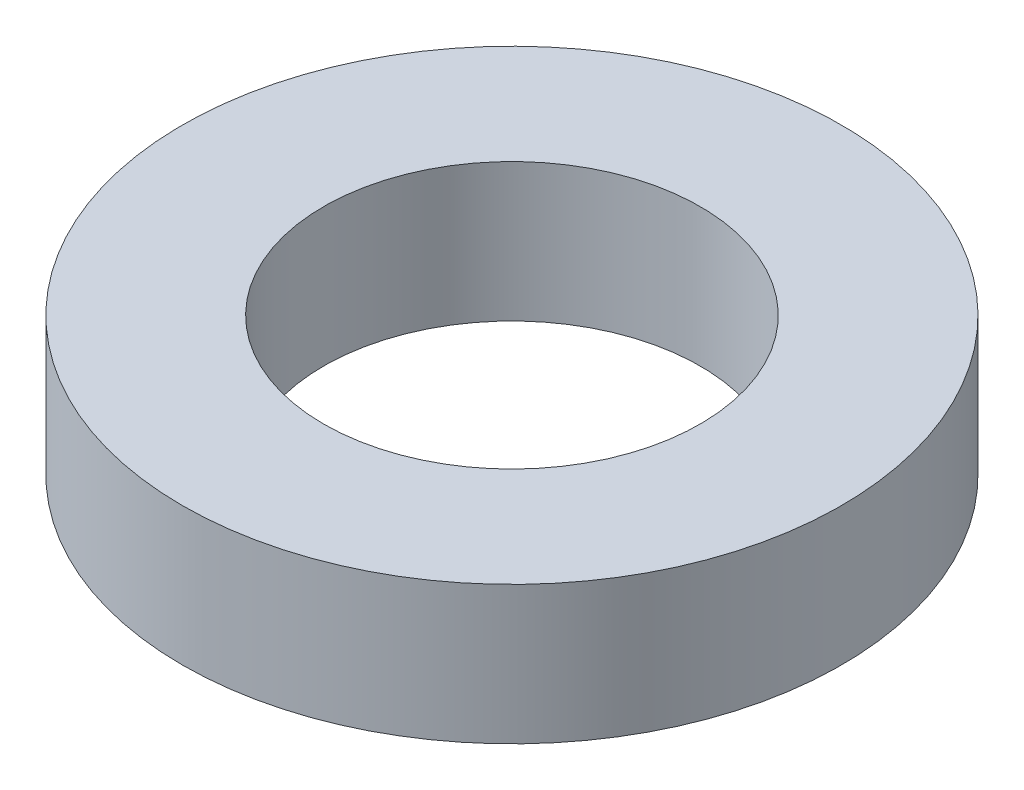
ISO-10303-21;
HEADER;
FILE_DESCRIPTION(('STEP AP214'),'2;1');
FILE_NAME('part.step','',(''),(''),'','','');
FILE_SCHEMA(('AUTOMOTIVE_DESIGN { 1 0 10303 214 1 1 1 1 }'));
ENDSEC;
DATA;
#1=APPLICATION_CONTEXT('core data for automotive mechanical design processes');
#2=APPLICATION_PROTOCOL_DEFINITION('international standard','automotive_design',2000,#1);
#3=PRODUCT_CONTEXT('',#1,'mechanical');
#4=PRODUCT('Part','Part','',(#3));
#5=PRODUCT_RELATED_PRODUCT_CATEGORY('part','',(#4));
#6=PRODUCT_DEFINITION_FORMATION('','',#4);
#7=PRODUCT_DEFINITION_CONTEXT('part definition',#1,'design');
#8=PRODUCT_DEFINITION('design','',#6,#7);
#9=PRODUCT_DEFINITION_SHAPE('','',#8);
#10=(LENGTH_UNIT() NAMED_UNIT(*) SI_UNIT(.MILLI.,.METRE.));
#11=(NAMED_UNIT(*) PLANE_ANGLE_UNIT() SI_UNIT($,.RADIAN.));
#12=(NAMED_UNIT(*) SI_UNIT($,.STERADIAN.) SOLID_ANGLE_UNIT());
#13=UNCERTAINTY_MEASURE_WITH_UNIT(LENGTH_MEASURE(1.E-05),#10,'distance_accuracy_value','');
#14=(GEOMETRIC_REPRESENTATION_CONTEXT(3) GLOBAL_UNCERTAINTY_ASSIGNED_CONTEXT((#13)) GLOBAL_UNIT_ASSIGNED_CONTEXT((#10,
#11,#12)) REPRESENTATION_CONTEXT('',''));
#15=CARTESIAN_POINT('',(0.,0.,0.));
#16=DIRECTION('',(0.,0.,1.));
#17=DIRECTION('',(1.,0.,0.));
#18=AXIS2_PLACEMENT_3D('',#15,#16,#17);
#19=CARTESIAN_POINT('',(0.,22.,0.));
#20=DIRECTION('',(0.,-1.,0.));
#21=DIRECTION('',(0.,0.,-1.));
#22=AXIS2_PLACEMENT_3D('',#19,#20,#21);
#23=CYLINDRICAL_SURFACE('',#22,52.5);
#24=CARTESIAN_POINT('',(0.,22.,0.));
#25=DIRECTION('',(0.,1.,0.));
#26=DIRECTION('',(0.,0.,1.));
#27=AXIS2_PLACEMENT_3D('',#24,#25,#26);
#28=CIRCLE('',#27,52.5);
#29=CARTESIAN_POINT('',(0.,22.,52.5));
#30=VERTEX_POINT('',#29);
#31=EDGE_CURVE('E10',#30,#30,#28,.T.);
#32=ORIENTED_EDGE('',*,*,#31,.F.);
#33=EDGE_LOOP('',(#32));
#34=FACE_BOUND('',#33,.T.);
#35=CARTESIAN_POINT('',(0.,0.,0.));
#36=DIRECTION('',(0.,1.,0.));
#37=DIRECTION('',(0.,0.,1.));
#38=AXIS2_PLACEMENT_3D('',#35,#36,#37);
#39=CIRCLE('',#38,52.5);
#40=CARTESIAN_POINT('',(0.,0.,52.5));
#41=VERTEX_POINT('',#40);
#42=EDGE_CURVE('E37',#41,#41,#39,.T.);
#43=ORIENTED_EDGE('',*,*,#42,.T.);
#44=EDGE_LOOP('',(#43));
#45=FACE_BOUND('',#44,.T.);
#46=ADVANCED_FACE('F40',(#34,#45),#23,.T.);
#47=CARTESIAN_POINT('',(0.,22.,0.));
#48=DIRECTION('',(0.,1.,0.));
#49=DIRECTION('',(0.,0.,1.));
#50=AXIS2_PLACEMENT_3D('',#47,#48,#49);
#51=PLANE('',#50);
#52=CARTESIAN_POINT('',(0.,22.,0.));
#53=DIRECTION('',(0.,1.,0.));
#54=DIRECTION('',(0.,0.,1.));
#55=AXIS2_PLACEMENT_3D('',#52,#53,#54);
#56=CIRCLE('',#55,30.);
#57=CARTESIAN_POINT('',(0.,22.,30.));
#58=VERTEX_POINT('',#57);
#59=EDGE_CURVE('E50',#58,#58,#56,.T.);
#60=ORIENTED_EDGE('',*,*,#59,.F.);
#61=EDGE_LOOP('',(#60));
#62=FACE_BOUND('',#61,.T.);
#63=ORIENTED_EDGE('',*,*,#31,.T.);
#64=EDGE_LOOP('',(#63));
#65=FACE_BOUND('',#64,.T.);
#66=ADVANCED_FACE('F59',(#62,#65),#51,.T.);
#67=CARTESIAN_POINT('',(0.,0.,0.));
#68=DIRECTION('',(0.,1.,0.));
#69=DIRECTION('',(0.,0.,1.));
#70=AXIS2_PLACEMENT_3D('',#67,#68,#69);
#71=PLANE('',#70);
#72=CARTESIAN_POINT('',(0.,0.,0.));
#73=DIRECTION('',(0.,1.,0.));
#74=DIRECTION('',(0.,0.,1.));
#75=AXIS2_PLACEMENT_3D('',#72,#73,#74);
#76=CIRCLE('',#75,30.);
#77=CARTESIAN_POINT('',(0.,0.,30.));
#78=VERTEX_POINT('',#77);
#79=EDGE_CURVE('E47',#78,#78,#76,.T.);
#80=ORIENTED_EDGE('',*,*,#79,.T.);
#81=EDGE_LOOP('',(#80));
#82=FACE_BOUND('',#81,.T.);
#83=ORIENTED_EDGE('',*,*,#42,.F.);
#84=EDGE_LOOP('',(#83));
#85=FACE_BOUND('',#84,.T.);
#86=ADVANCED_FACE('F58',(#82,#85),#71,.F.);
#87=CARTESIAN_POINT('',(0.,22.,0.));
#88=DIRECTION('',(0.,-1.,0.));
#89=DIRECTION('',(0.,0.,-1.));
#90=AXIS2_PLACEMENT_3D('',#87,#88,#89);
#91=CYLINDRICAL_SURFACE('',#90,30.);
#92=ORIENTED_EDGE('',*,*,#59,.T.);
#93=EDGE_LOOP('',(#92));
#94=FACE_BOUND('',#93,.T.);
#95=ORIENTED_EDGE('',*,*,#79,.F.);
#96=EDGE_LOOP('',(#95));
#97=FACE_BOUND('',#96,.T.);
#98=ADVANCED_FACE('F54',(#94,#97),#91,.F.);
#99=CLOSED_SHELL('',(#46,#66,#86,#98));
#100=MANIFOLD_SOLID_BREP('B2',#99);
#101=ADVANCED_BREP_SHAPE_REPRESENTATION('',(#18,#100),#14);
#102=SHAPE_DEFINITION_REPRESENTATION(#9,#101);
ENDSEC;
END-ISO-10303-21;
